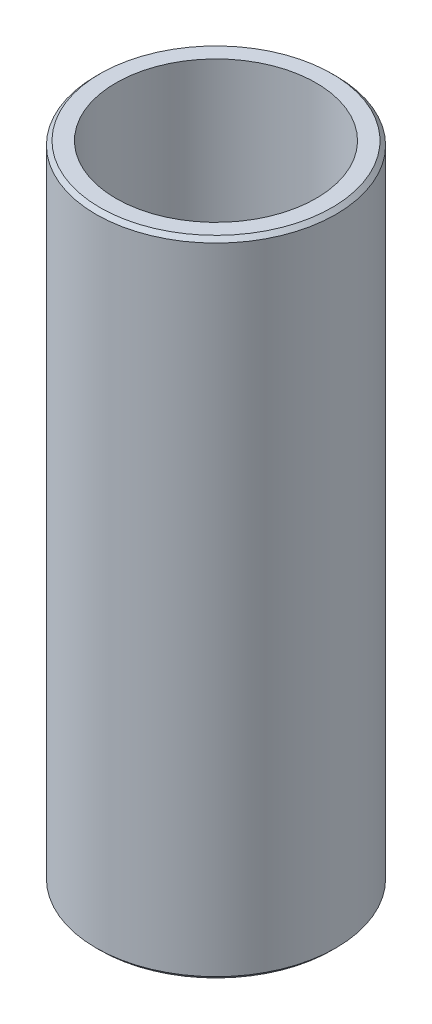
ISO-10303-21;
HEADER;
FILE_DESCRIPTION(('STEP AP214'),'2;1');
FILE_NAME('part.step','',(''),(''),'','','');
FILE_SCHEMA(('AUTOMOTIVE_DESIGN { 1 0 10303 214 1 1 1 1 }'));
ENDSEC;
DATA;
#1=APPLICATION_CONTEXT('core data for automotive mechanical design processes');
#2=APPLICATION_PROTOCOL_DEFINITION('international standard','automotive_design',2000,#1);
#3=PRODUCT_CONTEXT('',#1,'mechanical');
#4=PRODUCT('Part','Part','',(#3));
#5=PRODUCT_RELATED_PRODUCT_CATEGORY('part','',(#4));
#6=PRODUCT_DEFINITION_FORMATION('','',#4);
#7=PRODUCT_DEFINITION_CONTEXT('part definition',#1,'design');
#8=PRODUCT_DEFINITION('design','',#6,#7);
#9=PRODUCT_DEFINITION_SHAPE('','',#8);
#10=(LENGTH_UNIT() NAMED_UNIT(*) SI_UNIT(.MILLI.,.METRE.));
#11=(NAMED_UNIT(*) PLANE_ANGLE_UNIT() SI_UNIT($,.RADIAN.));
#12=(NAMED_UNIT(*) SI_UNIT($,.STERADIAN.) SOLID_ANGLE_UNIT());
#13=UNCERTAINTY_MEASURE_WITH_UNIT(LENGTH_MEASURE(1.E-05),#10,'distance_accuracy_value','');
#14=(GEOMETRIC_REPRESENTATION_CONTEXT(3) GLOBAL_UNCERTAINTY_ASSIGNED_CONTEXT((#13)) GLOBAL_UNIT_ASSIGNED_CONTEXT((#10,
#11,#12)) REPRESENTATION_CONTEXT('',''));
#15=CARTESIAN_POINT('',(0.,0.,0.));
#16=DIRECTION('',(0.,0.,1.));
#17=DIRECTION('',(1.,0.,0.));
#18=AXIS2_PLACEMENT_3D('',#15,#16,#17);
#19=CARTESIAN_POINT('',(0.,268.144726716984,0.));
#20=DIRECTION('',(0.,-1.,0.));
#21=DIRECTION('',(0.,0.,-1.));
#22=AXIS2_PLACEMENT_3D('',#19,#20,#21);
#23=CYLINDRICAL_SURFACE('',#22,50.);
#24=CARTESIAN_POINT('',(0.,266.505219176765,0.));
#25=DIRECTION('',(0.,1.,0.));
#26=DIRECTION('',(0.,0.,1.));
#27=AXIS2_PLACEMENT_3D('',#24,#25,#26);
#28=CIRCLE('',#27,50.);
#29=CARTESIAN_POINT('',(0.,266.505219176765,50.));
#30=VERTEX_POINT('',#29);
#31=EDGE_CURVE('E50',#30,#30,#28,.F.);
#32=ORIENTED_EDGE('',*,*,#31,.T.);
#33=EDGE_LOOP('',(#32));
#34=FACE_BOUND('',#33,.T.);
#35=CARTESIAN_POINT('',(0.,1.63950754021863,0.));
#36=DIRECTION('',(0.,1.,0.));
#37=DIRECTION('',(0.,0.,1.));
#38=AXIS2_PLACEMENT_3D('',#35,#36,#37);
#39=CIRCLE('',#38,50.);
#40=CARTESIAN_POINT('',(0.,1.63950754021863,50.));
#41=VERTEX_POINT('',#40);
#42=EDGE_CURVE('E51',#41,#41,#39,.T.);
#43=ORIENTED_EDGE('',*,*,#42,.T.);
#44=EDGE_LOOP('',(#43));
#45=FACE_BOUND('',#44,.T.);
#46=ADVANCED_FACE('F39',(#34,#45),#23,.T.);
#47=CARTESIAN_POINT('',(0.,268.144726716984,0.));
#48=DIRECTION('',(0.,1.,0.));
#49=DIRECTION('',(0.,0.,1.));
#50=AXIS2_PLACEMENT_3D('',#47,#48,#49);
#51=PLANE('',#50);
#52=CARTESIAN_POINT('',(0.,268.144726716984,0.));
#53=DIRECTION('',(0.,1.,0.));
#54=DIRECTION('',(0.,0.,1.));
#55=AXIS2_PLACEMENT_3D('',#52,#53,#54);
#56=CIRCLE('',#55,48.3604924597814);
#57=CARTESIAN_POINT('',(0.,268.144726716984,48.3604924597814));
#58=VERTEX_POINT('',#57);
#59=EDGE_CURVE('E54',#58,#58,#56,.T.);
#60=ORIENTED_EDGE('',*,*,#59,.T.);
#61=EDGE_LOOP('',(#60));
#62=FACE_BOUND('',#61,.T.);
#63=CARTESIAN_POINT('',(0.,268.144726716984,0.));
#64=DIRECTION('',(0.,1.,0.));
#65=DIRECTION('',(0.,0.,1.));
#66=AXIS2_PLACEMENT_3D('',#63,#64,#65);
#67=CIRCLE('',#66,41.7348184999113);
#68=CARTESIAN_POINT('',(0.,268.144726716984,41.7348184999113));
#69=VERTEX_POINT('',#68);
#70=EDGE_CURVE('E58',#69,#69,#67,.T.);
#71=ORIENTED_EDGE('',*,*,#70,.F.);
#72=EDGE_LOOP('',(#71));
#73=FACE_BOUND('',#72,.T.);
#74=ADVANCED_FACE('F69',(#62,#73),#51,.T.);
#75=CARTESIAN_POINT('',(0.,0.,0.));
#76=DIRECTION('',(0.,1.,0.));
#77=DIRECTION('',(0.,0.,1.));
#78=AXIS2_PLACEMENT_3D('',#75,#76,#77);
#79=PLANE('',#78);
#80=CARTESIAN_POINT('',(0.,0.,0.));
#81=DIRECTION('',(0.,1.,0.));
#82=DIRECTION('',(0.,0.,1.));
#83=AXIS2_PLACEMENT_3D('',#80,#81,#82);
#84=CIRCLE('',#83,48.3604924597813);
#85=CARTESIAN_POINT('',(0.,0.,48.3604924597813));
#86=VERTEX_POINT('',#85);
#87=EDGE_CURVE('E10',#86,#86,#84,.F.);
#88=ORIENTED_EDGE('',*,*,#87,.T.);
#89=EDGE_LOOP('',(#88));
#90=FACE_BOUND('',#89,.T.);
#91=CARTESIAN_POINT('',(0.,0.,0.));
#92=DIRECTION('',(0.,1.,0.));
#93=DIRECTION('',(0.,0.,1.));
#94=AXIS2_PLACEMENT_3D('',#91,#92,#93);
#95=CIRCLE('',#94,41.7348184999113);
#96=CARTESIAN_POINT('',(0.,0.,41.7348184999113));
#97=VERTEX_POINT('',#96);
#98=EDGE_CURVE('E63',#97,#97,#95,.T.);
#99=ORIENTED_EDGE('',*,*,#98,.T.);
#100=EDGE_LOOP('',(#99));
#101=FACE_BOUND('',#100,.T.);
#102=ADVANCED_FACE('F75',(#90,#101),#79,.F.);
#103=CARTESIAN_POINT('',(0.,268.144726716984,0.));
#104=DIRECTION('',(0.,-1.,0.));
#105=DIRECTION('',(0.,0.,-1.));
#106=AXIS2_PLACEMENT_3D('',#103,#104,#105);
#107=CYLINDRICAL_SURFACE('',#106,41.7348184999113);
#108=ORIENTED_EDGE('',*,*,#70,.T.);
#109=EDGE_LOOP('',(#108));
#110=FACE_BOUND('',#109,.T.);
#111=ORIENTED_EDGE('',*,*,#98,.F.);
#112=EDGE_LOOP('',(#111));
#113=FACE_BOUND('',#112,.T.);
#114=ADVANCED_FACE('F70',(#110,#113),#107,.F.);
#115=CARTESIAN_POINT('',(0.,268.144726716984,0.));
#116=DIRECTION('',(0.,-1.,0.));
#117=DIRECTION('',(0.,0.,-1.));
#118=AXIS2_PLACEMENT_3D('',#115,#116,#117);
#119=CONICAL_SURFACE('',#118,48.3604924597814,0.785398163397463);
#120=ORIENTED_EDGE('',*,*,#31,.F.);
#121=EDGE_LOOP('',(#120));
#122=FACE_BOUND('',#121,.T.);
#123=ORIENTED_EDGE('',*,*,#59,.F.);
#124=EDGE_LOOP('',(#123));
#125=FACE_BOUND('',#124,.T.);
#126=ADVANCED_FACE('F81',(#122,#125),#119,.T.);
#127=CARTESIAN_POINT('',(0.,1.63950754021863,0.));
#128=DIRECTION('',(0.,1.,0.));
#129=DIRECTION('',(0.,0.,1.));
#130=AXIS2_PLACEMENT_3D('',#127,#128,#129);
#131=CONICAL_SURFACE('',#130,50.,0.785398163397459);
#132=ORIENTED_EDGE('',*,*,#87,.F.);
#133=EDGE_LOOP('',(#132));
#134=FACE_BOUND('',#133,.T.);
#135=ORIENTED_EDGE('',*,*,#42,.F.);
#136=EDGE_LOOP('',(#135));
#137=FACE_BOUND('',#136,.T.);
#138=ADVANCED_FACE('F45',(#134,#137),#131,.T.);
#139=CLOSED_SHELL('',(#46,#74,#102,#114,#126,#138));
#140=MANIFOLD_SOLID_BREP('B2',#139);
#141=ADVANCED_BREP_SHAPE_REPRESENTATION('',(#18,#140),#14);
#142=SHAPE_DEFINITION_REPRESENTATION(#9,#141);
ENDSEC;
END-ISO-10303-21;
